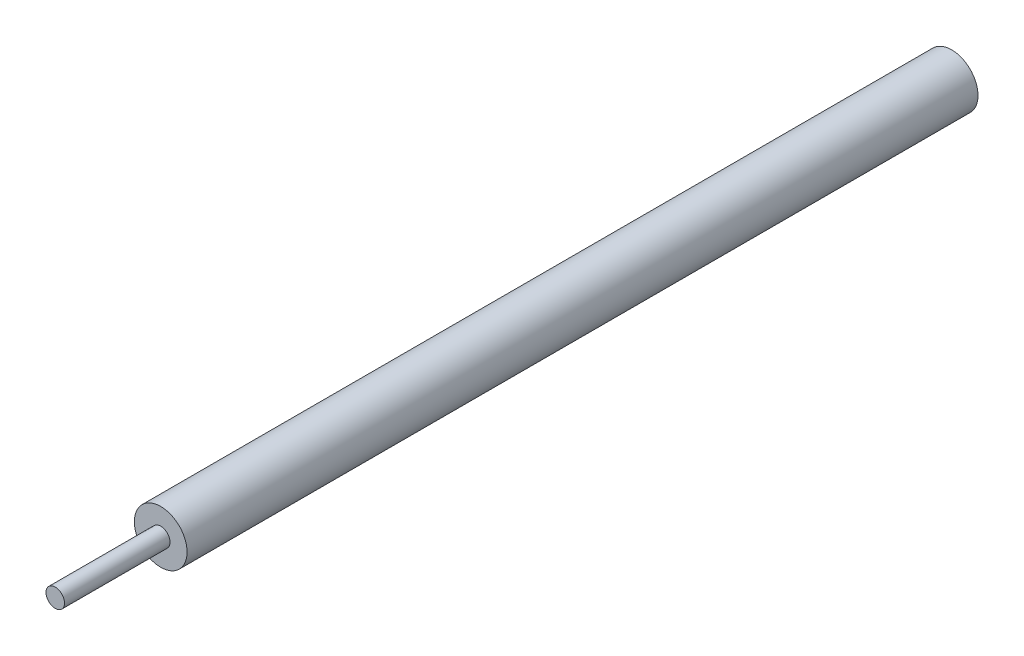
ISO-10303-21;
HEADER;
FILE_DESCRIPTION(('STEP AP214'),'2;1');
FILE_NAME('part.step','',(''),(''),'','','');
FILE_SCHEMA(('AUTOMOTIVE_DESIGN { 1 0 10303 214 1 1 1 1 }'));
ENDSEC;
DATA;
#1=APPLICATION_CONTEXT('core data for automotive mechanical design processes');
#2=APPLICATION_PROTOCOL_DEFINITION('international standard','automotive_design',2000,#1);
#3=PRODUCT_CONTEXT('',#1,'mechanical');
#4=PRODUCT('Part','Part','',(#3));
#5=PRODUCT_RELATED_PRODUCT_CATEGORY('part','',(#4));
#6=PRODUCT_DEFINITION_FORMATION('','',#4);
#7=PRODUCT_DEFINITION_CONTEXT('part definition',#1,'design');
#8=PRODUCT_DEFINITION('design','',#6,#7);
#9=PRODUCT_DEFINITION_SHAPE('','',#8);
#10=(LENGTH_UNIT() NAMED_UNIT(*) SI_UNIT(.MILLI.,.METRE.));
#11=(NAMED_UNIT(*) PLANE_ANGLE_UNIT() SI_UNIT($,.RADIAN.));
#12=(NAMED_UNIT(*) SI_UNIT($,.STERADIAN.) SOLID_ANGLE_UNIT());
#13=UNCERTAINTY_MEASURE_WITH_UNIT(LENGTH_MEASURE(1.E-05),#10,'distance_accuracy_value','');
#14=(GEOMETRIC_REPRESENTATION_CONTEXT(3) GLOBAL_UNCERTAINTY_ASSIGNED_CONTEXT((#13)) GLOBAL_UNIT_ASSIGNED_CONTEXT((#10,
#11,#12)) REPRESENTATION_CONTEXT('',''));
#15=CARTESIAN_POINT('',(0.,0.,0.));
#16=DIRECTION('',(0.,0.,1.));
#17=DIRECTION('',(1.,0.,0.));
#18=AXIS2_PLACEMENT_3D('',#15,#16,#17);
#19=CARTESIAN_POINT('',(0.,0.,150.));
#20=DIRECTION('',(0.,0.,-1.));
#21=DIRECTION('',(-1.,0.,0.));
#22=AXIS2_PLACEMENT_3D('',#19,#20,#21);
#23=CYLINDRICAL_SURFACE('',#22,5.);
#24=CARTESIAN_POINT('',(0.,0.,150.));
#25=DIRECTION('',(0.,0.,1.));
#26=DIRECTION('',(1.,0.,0.));
#27=AXIS2_PLACEMENT_3D('',#24,#25,#26);
#28=CIRCLE('',#27,5.);
#29=CARTESIAN_POINT('',(5.,0.,150.));
#30=VERTEX_POINT('',#29);
#31=EDGE_CURVE('E45',#30,#30,#28,.T.);
#32=ORIENTED_EDGE('',*,*,#31,.F.);
#33=EDGE_LOOP('',(#32));
#34=FACE_BOUND('',#33,.T.);
#35=CARTESIAN_POINT('',(0.,0.,0.));
#36=DIRECTION('',(0.,0.,1.));
#37=DIRECTION('',(1.,0.,0.));
#38=AXIS2_PLACEMENT_3D('',#35,#36,#37);
#39=CIRCLE('',#38,5.);
#40=CARTESIAN_POINT('',(5.,0.,0.));
#41=VERTEX_POINT('',#40);
#42=EDGE_CURVE('E40',#41,#41,#39,.T.);
#43=ORIENTED_EDGE('',*,*,#42,.T.);
#44=EDGE_LOOP('',(#43));
#45=FACE_BOUND('',#44,.T.);
#46=ADVANCED_FACE('F37',(#34,#45),#23,.T.);
#47=CARTESIAN_POINT('',(0.,0.,150.));
#48=DIRECTION('',(0.,0.,1.));
#49=DIRECTION('',(1.,0.,0.));
#50=AXIS2_PLACEMENT_3D('',#47,#48,#49);
#51=PLANE('',#50);
#52=CARTESIAN_POINT('',(0.,0.,150.));
#53=DIRECTION('',(0.,0.,1.));
#54=DIRECTION('',(1.,0.,0.));
#55=AXIS2_PLACEMENT_3D('',#52,#53,#54);
#56=CIRCLE('',#55,1.75919229798579);
#57=CARTESIAN_POINT('',(1.75919229798579,0.,150.));
#58=VERTEX_POINT('',#57);
#59=EDGE_CURVE('E10',#58,#58,#56,.T.);
#60=ORIENTED_EDGE('',*,*,#59,.F.);
#61=EDGE_LOOP('',(#60));
#62=FACE_BOUND('',#61,.T.);
#63=ORIENTED_EDGE('',*,*,#31,.T.);
#64=EDGE_LOOP('',(#63));
#65=FACE_BOUND('',#64,.T.);
#66=ADVANCED_FACE('F65',(#62,#65),#51,.T.);
#67=CARTESIAN_POINT('',(0.,0.,0.));
#68=DIRECTION('',(0.,0.,1.));
#69=DIRECTION('',(1.,0.,0.));
#70=AXIS2_PLACEMENT_3D('',#67,#68,#69);
#71=PLANE('',#70);
#72=ORIENTED_EDGE('',*,*,#42,.F.);
#73=EDGE_LOOP('',(#72));
#74=FACE_BOUND('',#73,.T.);
#75=ADVANCED_FACE('F62',(#74),#71,.F.);
#76=CARTESIAN_POINT('',(0.,0.,170.));
#77=DIRECTION('',(0.,0.,-1.));
#78=DIRECTION('',(-1.,0.,0.));
#79=AXIS2_PLACEMENT_3D('',#76,#77,#78);
#80=CYLINDRICAL_SURFACE('',#79,1.75919229798579);
#81=CARTESIAN_POINT('',(0.,0.,170.));
#82=DIRECTION('',(0.,0.,1.));
#83=DIRECTION('',(1.,0.,0.));
#84=AXIS2_PLACEMENT_3D('',#81,#82,#83);
#85=CIRCLE('',#84,1.75919229798579);
#86=CARTESIAN_POINT('',(1.75919229798579,0.,170.));
#87=VERTEX_POINT('',#86);
#88=EDGE_CURVE('E52',#87,#87,#85,.T.);
#89=ORIENTED_EDGE('',*,*,#88,.F.);
#90=EDGE_LOOP('',(#89));
#91=FACE_BOUND('',#90,.T.);
#92=ORIENTED_EDGE('',*,*,#59,.T.);
#93=EDGE_LOOP('',(#92));
#94=FACE_BOUND('',#93,.T.);
#95=ADVANCED_FACE('F64',(#91,#94),#80,.T.);
#96=CARTESIAN_POINT('',(0.,0.,170.));
#97=DIRECTION('',(0.,0.,1.));
#98=DIRECTION('',(1.,0.,0.));
#99=AXIS2_PLACEMENT_3D('',#96,#97,#98);
#100=PLANE('',#99);
#101=ORIENTED_EDGE('',*,*,#88,.T.);
#102=EDGE_LOOP('',(#101));
#103=FACE_BOUND('',#102,.T.);
#104=ADVANCED_FACE('F70',(#103),#100,.T.);
#105=CLOSED_SHELL('',(#46,#66,#75,#95,#104));
#106=MANIFOLD_SOLID_BREP('B2',#105);
#107=ADVANCED_BREP_SHAPE_REPRESENTATION('',(#18,#106),#14);
#108=SHAPE_DEFINITION_REPRESENTATION(#9,#107);
ENDSEC;
END-ISO-10303-21;
